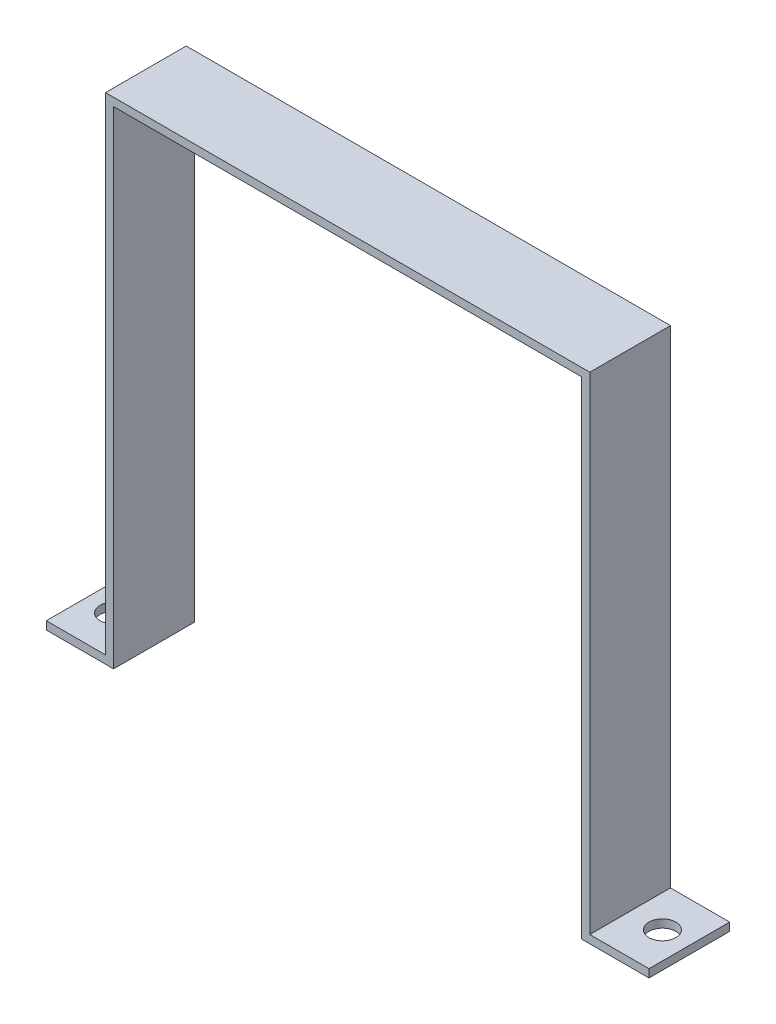
ISO-10303-21;
HEADER;
FILE_DESCRIPTION(('STEP AP214'),'2;1');
FILE_NAME('part.step','',(''),(''),'','','');
FILE_SCHEMA(('AUTOMOTIVE_DESIGN { 1 0 10303 214 1 1 1 1 }'));
ENDSEC;
DATA;
#1=APPLICATION_CONTEXT('core data for automotive mechanical design processes');
#2=APPLICATION_PROTOCOL_DEFINITION('international standard','automotive_design',2000,#1);
#3=PRODUCT_CONTEXT('',#1,'mechanical');
#4=PRODUCT('Part','Part','',(#3));
#5=PRODUCT_RELATED_PRODUCT_CATEGORY('part','',(#4));
#6=PRODUCT_DEFINITION_FORMATION('','',#4);
#7=PRODUCT_DEFINITION_CONTEXT('part definition',#1,'design');
#8=PRODUCT_DEFINITION('design','',#6,#7);
#9=PRODUCT_DEFINITION_SHAPE('','',#8);
#10=(LENGTH_UNIT() NAMED_UNIT(*) SI_UNIT(.MILLI.,.METRE.));
#11=(NAMED_UNIT(*) PLANE_ANGLE_UNIT() SI_UNIT($,.RADIAN.));
#12=(NAMED_UNIT(*) SI_UNIT($,.STERADIAN.) SOLID_ANGLE_UNIT());
#13=UNCERTAINTY_MEASURE_WITH_UNIT(LENGTH_MEASURE(1.E-05),#10,'distance_accuracy_value','');
#14=(GEOMETRIC_REPRESENTATION_CONTEXT(3) GLOBAL_UNCERTAINTY_ASSIGNED_CONTEXT((#13)) GLOBAL_UNIT_ASSIGNED_CONTEXT((#10,
#11,#12)) REPRESENTATION_CONTEXT('',''));
#15=CARTESIAN_POINT('',(0.,0.,0.));
#16=DIRECTION('',(0.,0.,1.));
#17=DIRECTION('',(1.,0.,0.));
#18=AXIS2_PLACEMENT_3D('',#15,#16,#17);
#19=CARTESIAN_POINT('',(-112.,0.,30.));
#20=DIRECTION('',(0.,1.,0.));
#21=DIRECTION('',(0.,0.,1.));
#22=AXIS2_PLACEMENT_3D('',#19,#20,#21);
#23=PLANE('',#22);
#24=CARTESIAN_POINT('',(-102.,0.,15.));
#25=DIRECTION('',(0.,1.,0.));
#26=DIRECTION('',(0.,0.,1.));
#27=AXIS2_PLACEMENT_3D('',#24,#25,#26);
#28=CIRCLE('',#27,5.);
#29=CARTESIAN_POINT('',(-102.,0.,20.));
#30=VERTEX_POINT('',#29);
#31=EDGE_CURVE('E301',#30,#30,#28,.T.);
#32=ORIENTED_EDGE('',*,*,#31,.T.);
#33=EDGE_LOOP('',(#32));
#34=FACE_BOUND('',#33,.T.);
#35=DIRECTION('',(1.,0.,0.));
#36=VECTOR('',#35,1.);
#37=CARTESIAN_POINT('',(-112.,0.,0.));
#38=LINE('',#37,#36);
#39=CARTESIAN_POINT('',(-112.,0.,0.));
#40=VERTEX_POINT('',#39);
#41=CARTESIAN_POINT('',(-87.,0.,0.));
#42=VERTEX_POINT('',#41);
#43=EDGE_CURVE('E164',#40,#42,#38,.T.);
#44=ORIENTED_EDGE('',*,*,#43,.T.);
#45=DIRECTION('',(0.,0.,-1.));
#46=VECTOR('',#45,1.);
#47=CARTESIAN_POINT('',(-87.,0.,30.));
#48=LINE('',#47,#46);
#49=CARTESIAN_POINT('',(-87.,0.,30.));
#50=VERTEX_POINT('',#49);
#51=EDGE_CURVE('E11',#50,#42,#48,.T.);
#52=ORIENTED_EDGE('',*,*,#51,.F.);
#53=DIRECTION('',(1.,0.,0.));
#54=VECTOR('',#53,1.);
#55=CARTESIAN_POINT('',(-112.,0.,30.));
#56=LINE('',#55,#54);
#57=CARTESIAN_POINT('',(-112.,0.,30.));
#58=VERTEX_POINT('',#57);
#59=EDGE_CURVE('E199',#58,#50,#56,.T.);
#60=ORIENTED_EDGE('',*,*,#59,.F.);
#61=DIRECTION('',(0.,0.,-1.));
#62=VECTOR('',#61,1.);
#63=CARTESIAN_POINT('',(-112.,0.,30.));
#64=LINE('',#63,#62);
#65=EDGE_CURVE('E160',#58,#40,#64,.T.);
#66=ORIENTED_EDGE('',*,*,#65,.T.);
#67=EDGE_LOOP('',(#44,#52,#60,#66));
#68=FACE_BOUND('',#67,.T.);
#69=ADVANCED_FACE('F39',(#34,#68),#23,.F.);
#70=CARTESIAN_POINT('',(-87.,0.,30.));
#71=DIRECTION('',(-1.,0.,0.));
#72=DIRECTION('',(0.,0.,1.));
#73=AXIS2_PLACEMENT_3D('',#70,#71,#72);
#74=PLANE('',#73);
#75=DIRECTION('',(0.,1.,0.));
#76=VECTOR('',#75,1.);
#77=CARTESIAN_POINT('',(-87.,0.,0.));
#78=LINE('',#77,#76);
#79=CARTESIAN_POINT('',(-87.,181.,0.));
#80=VERTEX_POINT('',#79);
#81=EDGE_CURVE('E168',#42,#80,#78,.T.);
#82=ORIENTED_EDGE('',*,*,#81,.T.);
#83=DIRECTION('',(0.,0.,-1.));
#84=VECTOR('',#83,1.);
#85=CARTESIAN_POINT('',(-87.,181.,30.));
#86=LINE('',#85,#84);
#87=CARTESIAN_POINT('',(-87.,181.,30.));
#88=VERTEX_POINT('',#87);
#89=EDGE_CURVE('E48',#88,#80,#86,.T.);
#90=ORIENTED_EDGE('',*,*,#89,.F.);
#91=DIRECTION('',(0.,1.,0.));
#92=VECTOR('',#91,1.);
#93=CARTESIAN_POINT('',(-87.,0.,30.));
#94=LINE('',#93,#92);
#95=EDGE_CURVE('E111',#50,#88,#94,.T.);
#96=ORIENTED_EDGE('',*,*,#95,.F.);
#97=ORIENTED_EDGE('',*,*,#51,.T.);
#98=EDGE_LOOP('',(#82,#90,#96,#97));
#99=FACE_BOUND('',#98,.T.);
#100=ADVANCED_FACE('F294',(#99),#74,.F.);
#101=CARTESIAN_POINT('',(-87.,181.,30.));
#102=DIRECTION('',(0.,1.,0.));
#103=DIRECTION('',(0.,0.,1.));
#104=AXIS2_PLACEMENT_3D('',#101,#102,#103);
#105=PLANE('',#104);
#106=DIRECTION('',(1.,0.,0.));
#107=VECTOR('',#106,1.);
#108=CARTESIAN_POINT('',(-87.,181.,0.));
#109=LINE('',#108,#107);
#110=CARTESIAN_POINT('',(87.,181.,0.));
#111=VERTEX_POINT('',#110);
#112=EDGE_CURVE('E172',#80,#111,#109,.T.);
#113=ORIENTED_EDGE('',*,*,#112,.T.);
#114=DIRECTION('',(0.,0.,-1.));
#115=VECTOR('',#114,1.);
#116=CARTESIAN_POINT('',(87.,181.,30.));
#117=LINE('',#116,#115);
#118=CARTESIAN_POINT('',(87.,181.,30.));
#119=VERTEX_POINT('',#118);
#120=EDGE_CURVE('E226',#119,#111,#117,.T.);
#121=ORIENTED_EDGE('',*,*,#120,.F.);
#122=DIRECTION('',(1.,0.,0.));
#123=VECTOR('',#122,1.);
#124=CARTESIAN_POINT('',(-87.,181.,30.));
#125=LINE('',#124,#123);
#126=EDGE_CURVE('E236',#88,#119,#125,.T.);
#127=ORIENTED_EDGE('',*,*,#126,.F.);
#128=ORIENTED_EDGE('',*,*,#89,.T.);
#129=EDGE_LOOP('',(#113,#121,#127,#128));
#130=FACE_BOUND('',#129,.T.);
#131=ADVANCED_FACE('F234',(#130),#105,.F.);
#132=CARTESIAN_POINT('',(87.,181.,30.));
#133=DIRECTION('',(1.,0.,0.));
#134=DIRECTION('',(0.,1.,0.));
#135=AXIS2_PLACEMENT_3D('',#132,#133,#134);
#136=PLANE('',#135);
#137=DIRECTION('',(0.,-1.,0.));
#138=VECTOR('',#137,1.);
#139=CARTESIAN_POINT('',(87.,181.,0.));
#140=LINE('',#139,#138);
#141=CARTESIAN_POINT('',(87.,0.,0.));
#142=VERTEX_POINT('',#141);
#143=EDGE_CURVE('E175',#111,#142,#140,.T.);
#144=ORIENTED_EDGE('',*,*,#143,.T.);
#145=DIRECTION('',(0.,0.,-1.));
#146=VECTOR('',#145,1.);
#147=CARTESIAN_POINT('',(87.,0.,30.));
#148=LINE('',#147,#146);
#149=CARTESIAN_POINT('',(87.,0.,30.));
#150=VERTEX_POINT('',#149);
#151=EDGE_CURVE('E222',#150,#142,#148,.T.);
#152=ORIENTED_EDGE('',*,*,#151,.F.);
#153=DIRECTION('',(0.,-1.,0.));
#154=VECTOR('',#153,1.);
#155=CARTESIAN_POINT('',(87.,181.,30.));
#156=LINE('',#155,#154);
#157=EDGE_CURVE('E255',#119,#150,#156,.T.);
#158=ORIENTED_EDGE('',*,*,#157,.F.);
#159=ORIENTED_EDGE('',*,*,#120,.T.);
#160=EDGE_LOOP('',(#144,#152,#158,#159));
#161=FACE_BOUND('',#160,.T.);
#162=ADVANCED_FACE('F245',(#161),#136,.F.);
#163=CARTESIAN_POINT('',(87.,0.,30.));
#164=DIRECTION('',(0.,1.,0.));
#165=DIRECTION('',(0.,0.,1.));
#166=AXIS2_PLACEMENT_3D('',#163,#164,#165);
#167=PLANE('',#166);
#168=CARTESIAN_POINT('',(102.,0.,15.));
#169=DIRECTION('',(0.,1.,0.));
#170=DIRECTION('',(0.,0.,1.));
#171=AXIS2_PLACEMENT_3D('',#168,#169,#170);
#172=CIRCLE('',#171,4.99999999999999);
#173=CARTESIAN_POINT('',(102.,0.,20.));
#174=VERTEX_POINT('',#173);
#175=EDGE_CURVE('E169',#174,#174,#172,.T.);
#176=ORIENTED_EDGE('',*,*,#175,.T.);
#177=EDGE_LOOP('',(#176));
#178=FACE_BOUND('',#177,.T.);
#179=DIRECTION('',(1.,0.,0.));
#180=VECTOR('',#179,1.);
#181=CARTESIAN_POINT('',(87.,0.,0.));
#182=LINE('',#181,#180);
#183=CARTESIAN_POINT('',(112.,0.,0.));
#184=VERTEX_POINT('',#183);
#185=EDGE_CURVE('E178',#142,#184,#182,.T.);
#186=ORIENTED_EDGE('',*,*,#185,.T.);
#187=DIRECTION('',(0.,0.,-1.));
#188=VECTOR('',#187,1.);
#189=CARTESIAN_POINT('',(112.,0.,30.));
#190=LINE('',#189,#188);
#191=CARTESIAN_POINT('',(112.,0.,30.));
#192=VERTEX_POINT('',#191);
#193=EDGE_CURVE('E218',#192,#184,#190,.T.);
#194=ORIENTED_EDGE('',*,*,#193,.F.);
#195=DIRECTION('',(1.,0.,0.));
#196=VECTOR('',#195,1.);
#197=CARTESIAN_POINT('',(87.,0.,30.));
#198=LINE('',#197,#196);
#199=EDGE_CURVE('E251',#150,#192,#198,.T.);
#200=ORIENTED_EDGE('',*,*,#199,.F.);
#201=ORIENTED_EDGE('',*,*,#151,.T.);
#202=EDGE_LOOP('',(#186,#194,#200,#201));
#203=FACE_BOUND('',#202,.T.);
#204=ADVANCED_FACE('F249',(#178,#203),#167,.F.);
#205=CARTESIAN_POINT('',(112.,0.,30.));
#206=DIRECTION('',(-1.,0.,0.));
#207=DIRECTION('',(0.,0.,1.));
#208=AXIS2_PLACEMENT_3D('',#205,#206,#207);
#209=PLANE('',#208);
#210=DIRECTION('',(0.,1.,0.));
#211=VECTOR('',#210,1.);
#212=CARTESIAN_POINT('',(112.,0.,0.));
#213=LINE('',#212,#211);
#214=CARTESIAN_POINT('',(112.,3.,0.));
#215=VERTEX_POINT('',#214);
#216=EDGE_CURVE('E181',#184,#215,#213,.T.);
#217=ORIENTED_EDGE('',*,*,#216,.T.);
#218=DIRECTION('',(0.,0.,-1.));
#219=VECTOR('',#218,1.);
#220=CARTESIAN_POINT('',(112.,3.,30.));
#221=LINE('',#220,#219);
#222=CARTESIAN_POINT('',(112.,3.,30.));
#223=VERTEX_POINT('',#222);
#224=EDGE_CURVE('E214',#223,#215,#221,.T.);
#225=ORIENTED_EDGE('',*,*,#224,.F.);
#226=DIRECTION('',(0.,1.,0.));
#227=VECTOR('',#226,1.);
#228=CARTESIAN_POINT('',(112.,0.,30.));
#229=LINE('',#228,#227);
#230=EDGE_CURVE('E254',#192,#223,#229,.T.);
#231=ORIENTED_EDGE('',*,*,#230,.F.);
#232=ORIENTED_EDGE('',*,*,#193,.T.);
#233=EDGE_LOOP('',(#217,#225,#231,#232));
#234=FACE_BOUND('',#233,.T.);
#235=ADVANCED_FACE('F329',(#234),#209,.F.);
#236=CARTESIAN_POINT('',(112.,3.,30.));
#237=DIRECTION('',(0.,-1.,0.));
#238=DIRECTION('',(1.,0.,0.));
#239=AXIS2_PLACEMENT_3D('',#236,#237,#238);
#240=PLANE('',#239);
#241=CARTESIAN_POINT('',(102.,3.00000000000003,15.));
#242=DIRECTION('',(0.,1.,0.));
#243=DIRECTION('',(-1.,0.,0.));
#244=AXIS2_PLACEMENT_3D('',#241,#242,#243);
#245=CIRCLE('',#244,4.99999999999999);
#246=CARTESIAN_POINT('',(97.0000000000001,3.00000000000002,15.));
#247=VERTEX_POINT('',#246);
#248=EDGE_CURVE('E311',#247,#247,#245,.T.);
#249=ORIENTED_EDGE('',*,*,#248,.F.);
#250=EDGE_LOOP('',(#249));
#251=FACE_BOUND('',#250,.T.);
#252=DIRECTION('',(-1.,0.,0.));
#253=VECTOR('',#252,1.);
#254=CARTESIAN_POINT('',(112.,3.,0.));
#255=LINE('',#254,#253);
#256=CARTESIAN_POINT('',(90.0000000000001,3.,0.));
#257=VERTEX_POINT('',#256);
#258=EDGE_CURVE('E184',#215,#257,#255,.T.);
#259=ORIENTED_EDGE('',*,*,#258,.T.);
#260=DIRECTION('',(0.,0.,-1.));
#261=VECTOR('',#260,1.);
#262=CARTESIAN_POINT('',(90.0000000000001,3.,30.));
#263=LINE('',#262,#261);
#264=CARTESIAN_POINT('',(90.0000000000001,3.,30.));
#265=VERTEX_POINT('',#264);
#266=EDGE_CURVE('E210',#265,#257,#263,.T.);
#267=ORIENTED_EDGE('',*,*,#266,.F.);
#268=DIRECTION('',(-1.,0.,0.));
#269=VECTOR('',#268,1.);
#270=CARTESIAN_POINT('',(112.,3.,30.));
#271=LINE('',#270,#269);
#272=EDGE_CURVE('E259',#223,#265,#271,.T.);
#273=ORIENTED_EDGE('',*,*,#272,.F.);
#274=ORIENTED_EDGE('',*,*,#224,.T.);
#275=EDGE_LOOP('',(#259,#267,#273,#274));
#276=FACE_BOUND('',#275,.T.);
#277=ADVANCED_FACE('F326',(#251,#276),#240,.F.);
#278=CARTESIAN_POINT('',(90.0000000000001,3.,30.));
#279=DIRECTION('',(-1.,0.,0.));
#280=DIRECTION('',(0.,0.,1.));
#281=AXIS2_PLACEMENT_3D('',#278,#279,#280);
#282=PLANE('',#281);
#283=DIRECTION('',(0.,1.,0.));
#284=VECTOR('',#283,1.);
#285=CARTESIAN_POINT('',(90.0000000000001,3.,0.));
#286=LINE('',#285,#284);
#287=CARTESIAN_POINT('',(90.0000000000001,184.,0.));
#288=VERTEX_POINT('',#287);
#289=EDGE_CURVE('E187',#257,#288,#286,.T.);
#290=ORIENTED_EDGE('',*,*,#289,.T.);
#291=DIRECTION('',(0.,0.,-1.));
#292=VECTOR('',#291,1.);
#293=CARTESIAN_POINT('',(90.0000000000001,184.,30.));
#294=LINE('',#293,#292);
#295=CARTESIAN_POINT('',(90.0000000000001,184.,30.));
#296=VERTEX_POINT('',#295);
#297=EDGE_CURVE('E206',#296,#288,#294,.T.);
#298=ORIENTED_EDGE('',*,*,#297,.F.);
#299=DIRECTION('',(0.,1.,0.));
#300=VECTOR('',#299,1.);
#301=CARTESIAN_POINT('',(90.0000000000001,3.,30.));
#302=LINE('',#301,#300);
#303=EDGE_CURVE('E266',#265,#296,#302,.T.);
#304=ORIENTED_EDGE('',*,*,#303,.F.);
#305=ORIENTED_EDGE('',*,*,#266,.T.);
#306=EDGE_LOOP('',(#290,#298,#304,#305));
#307=FACE_BOUND('',#306,.T.);
#308=ADVANCED_FACE('F274',(#307),#282,.F.);
#309=CARTESIAN_POINT('',(90.0000000000001,184.,30.));
#310=DIRECTION('',(0.,-1.,0.));
#311=DIRECTION('',(1.,0.,0.));
#312=AXIS2_PLACEMENT_3D('',#309,#310,#311);
#313=PLANE('',#312);
#314=DIRECTION('',(-1.,0.,0.));
#315=VECTOR('',#314,1.);
#316=CARTESIAN_POINT('',(90.0000000000001,184.,0.));
#317=LINE('',#316,#315);
#318=CARTESIAN_POINT('',(-90.,184.,0.));
#319=VERTEX_POINT('',#318);
#320=EDGE_CURVE('E190',#288,#319,#317,.T.);
#321=ORIENTED_EDGE('',*,*,#320,.T.);
#322=DIRECTION('',(0.,0.,-1.));
#323=VECTOR('',#322,1.);
#324=CARTESIAN_POINT('',(-90.,184.,30.));
#325=LINE('',#324,#323);
#326=CARTESIAN_POINT('',(-90.,184.,30.));
#327=VERTEX_POINT('',#326);
#328=EDGE_CURVE('E153',#327,#319,#325,.T.);
#329=ORIENTED_EDGE('',*,*,#328,.F.);
#330=DIRECTION('',(-1.,0.,0.));
#331=VECTOR('',#330,1.);
#332=CARTESIAN_POINT('',(90.0000000000001,184.,30.));
#333=LINE('',#332,#331);
#334=EDGE_CURVE('E142',#296,#327,#333,.T.);
#335=ORIENTED_EDGE('',*,*,#334,.F.);
#336=ORIENTED_EDGE('',*,*,#297,.T.);
#337=EDGE_LOOP('',(#321,#329,#335,#336));
#338=FACE_BOUND('',#337,.T.);
#339=ADVANCED_FACE('F278',(#338),#313,.F.);
#340=CARTESIAN_POINT('',(-90.,184.,30.));
#341=DIRECTION('',(1.,0.,0.));
#342=DIRECTION('',(0.,1.,0.));
#343=AXIS2_PLACEMENT_3D('',#340,#341,#342);
#344=PLANE('',#343);
#345=DIRECTION('',(0.,-1.,0.));
#346=VECTOR('',#345,1.);
#347=CARTESIAN_POINT('',(-90.,184.,0.));
#348=LINE('',#347,#346);
#349=CARTESIAN_POINT('',(-90.,3.,0.));
#350=VERTEX_POINT('',#349);
#351=EDGE_CURVE('E151',#319,#350,#348,.T.);
#352=ORIENTED_EDGE('',*,*,#351,.T.);
#353=DIRECTION('',(0.,0.,-1.));
#354=VECTOR('',#353,1.);
#355=CARTESIAN_POINT('',(-90.,3.,30.));
#356=LINE('',#355,#354);
#357=CARTESIAN_POINT('',(-90.,3.,30.));
#358=VERTEX_POINT('',#357);
#359=EDGE_CURVE('E148',#358,#350,#356,.T.);
#360=ORIENTED_EDGE('',*,*,#359,.F.);
#361=DIRECTION('',(0.,-1.,0.));
#362=VECTOR('',#361,1.);
#363=CARTESIAN_POINT('',(-90.,184.,30.));
#364=LINE('',#363,#362);
#365=EDGE_CURVE('E136',#327,#358,#364,.T.);
#366=ORIENTED_EDGE('',*,*,#365,.F.);
#367=ORIENTED_EDGE('',*,*,#328,.T.);
#368=EDGE_LOOP('',(#352,#360,#366,#367));
#369=FACE_BOUND('',#368,.T.);
#370=ADVANCED_FACE('F149',(#369),#344,.F.);
#371=CARTESIAN_POINT('',(-90.,3.,30.));
#372=DIRECTION('',(0.,-1.,0.));
#373=DIRECTION('',(1.,0.,0.));
#374=AXIS2_PLACEMENT_3D('',#371,#372,#373);
#375=PLANE('',#374);
#376=CARTESIAN_POINT('',(-102.,3.,15.));
#377=DIRECTION('',(0.,1.,0.));
#378=DIRECTION('',(-1.,0.,0.));
#379=AXIS2_PLACEMENT_3D('',#376,#377,#378);
#380=CIRCLE('',#379,5.);
#381=CARTESIAN_POINT('',(-107.,3.,15.));
#382=VERTEX_POINT('',#381);
#383=EDGE_CURVE('E304',#382,#382,#380,.T.);
#384=ORIENTED_EDGE('',*,*,#383,.F.);
#385=EDGE_LOOP('',(#384));
#386=FACE_BOUND('',#385,.T.);
#387=DIRECTION('',(-1.,0.,0.));
#388=VECTOR('',#387,1.);
#389=CARTESIAN_POINT('',(-90.,3.,0.));
#390=LINE('',#389,#388);
#391=CARTESIAN_POINT('',(-112.,3.,0.));
#392=VERTEX_POINT('',#391);
#393=EDGE_CURVE('E97',#350,#392,#390,.T.);
#394=ORIENTED_EDGE('',*,*,#393,.T.);
#395=DIRECTION('',(0.,0.,-1.));
#396=VECTOR('',#395,1.);
#397=CARTESIAN_POINT('',(-112.,3.,30.));
#398=LINE('',#397,#396);
#399=CARTESIAN_POINT('',(-112.,3.,30.));
#400=VERTEX_POINT('',#399);
#401=EDGE_CURVE('E154',#400,#392,#398,.T.);
#402=ORIENTED_EDGE('',*,*,#401,.F.);
#403=DIRECTION('',(-1.,0.,0.));
#404=VECTOR('',#403,1.);
#405=CARTESIAN_POINT('',(-90.,3.,30.));
#406=LINE('',#405,#404);
#407=EDGE_CURVE('E140',#358,#400,#406,.T.);
#408=ORIENTED_EDGE('',*,*,#407,.F.);
#409=ORIENTED_EDGE('',*,*,#359,.T.);
#410=EDGE_LOOP('',(#394,#402,#408,#409));
#411=FACE_BOUND('',#410,.T.);
#412=ADVANCED_FACE('F156',(#386,#411),#375,.F.);
#413=CARTESIAN_POINT('',(-112.,3.,30.));
#414=DIRECTION('',(1.,0.,0.));
#415=DIRECTION('',(0.,0.,-1.));
#416=AXIS2_PLACEMENT_3D('',#413,#414,#415);
#417=PLANE('',#416);
#418=DIRECTION('',(0.,-1.,0.));
#419=VECTOR('',#418,1.);
#420=CARTESIAN_POINT('',(-112.,3.,0.));
#421=LINE('',#420,#419);
#422=EDGE_CURVE('E103',#392,#40,#421,.T.);
#423=ORIENTED_EDGE('',*,*,#422,.T.);
#424=ORIENTED_EDGE('',*,*,#65,.F.);
#425=DIRECTION('',(0.,-1.,0.));
#426=VECTOR('',#425,1.);
#427=CARTESIAN_POINT('',(-112.,3.,30.));
#428=LINE('',#427,#426);
#429=EDGE_CURVE('E56',#400,#58,#428,.T.);
#430=ORIENTED_EDGE('',*,*,#429,.F.);
#431=ORIENTED_EDGE('',*,*,#401,.T.);
#432=EDGE_LOOP('',(#423,#424,#430,#431));
#433=FACE_BOUND('',#432,.T.);
#434=ADVANCED_FACE('F282',(#433),#417,.F.);
#435=CARTESIAN_POINT('',(0.,0.,30.));
#436=DIRECTION('',(0.,0.,1.));
#437=DIRECTION('',(1.,0.,0.));
#438=AXIS2_PLACEMENT_3D('',#435,#436,#437);
#439=PLANE('',#438);
#440=ORIENTED_EDGE('',*,*,#59,.T.);
#441=ORIENTED_EDGE('',*,*,#95,.T.);
#442=ORIENTED_EDGE('',*,*,#126,.T.);
#443=ORIENTED_EDGE('',*,*,#157,.T.);
#444=ORIENTED_EDGE('',*,*,#199,.T.);
#445=ORIENTED_EDGE('',*,*,#230,.T.);
#446=ORIENTED_EDGE('',*,*,#272,.T.);
#447=ORIENTED_EDGE('',*,*,#303,.T.);
#448=ORIENTED_EDGE('',*,*,#334,.T.);
#449=ORIENTED_EDGE('',*,*,#365,.T.);
#450=ORIENTED_EDGE('',*,*,#407,.T.);
#451=ORIENTED_EDGE('',*,*,#429,.T.);
#452=EDGE_LOOP('',(#440,#441,#442,#443,#444,#445,#446,#447,#448,#449,#450,#451));
#453=FACE_BOUND('',#452,.T.);
#454=ADVANCED_FACE('F138',(#453),#439,.T.);
#455=CARTESIAN_POINT('',(0.,0.,0.));
#456=DIRECTION('',(0.,0.,1.));
#457=DIRECTION('',(1.,0.,0.));
#458=AXIS2_PLACEMENT_3D('',#455,#456,#457);
#459=PLANE('',#458);
#460=ORIENTED_EDGE('',*,*,#43,.F.);
#461=ORIENTED_EDGE('',*,*,#422,.F.);
#462=ORIENTED_EDGE('',*,*,#393,.F.);
#463=ORIENTED_EDGE('',*,*,#351,.F.);
#464=ORIENTED_EDGE('',*,*,#320,.F.);
#465=ORIENTED_EDGE('',*,*,#289,.F.);
#466=ORIENTED_EDGE('',*,*,#258,.F.);
#467=ORIENTED_EDGE('',*,*,#216,.F.);
#468=ORIENTED_EDGE('',*,*,#185,.F.);
#469=ORIENTED_EDGE('',*,*,#143,.F.);
#470=ORIENTED_EDGE('',*,*,#112,.F.);
#471=ORIENTED_EDGE('',*,*,#81,.F.);
#472=EDGE_LOOP('',(#460,#461,#462,#463,#464,#465,#466,#467,#468,#469,#470,#471));
#473=FACE_BOUND('',#472,.T.);
#474=ADVANCED_FACE('F240',(#473),#459,.F.);
#475=CARTESIAN_POINT('',(-102.,-27.,15.));
#476=DIRECTION('',(0.,1.,0.));
#477=DIRECTION('',(-1.,0.,0.));
#478=AXIS2_PLACEMENT_3D('',#475,#476,#477);
#479=CYLINDRICAL_SURFACE('',#478,5.);
#480=ORIENTED_EDGE('',*,*,#383,.T.);
#481=EDGE_LOOP('',(#480));
#482=FACE_BOUND('',#481,.T.);
#483=ORIENTED_EDGE('',*,*,#31,.F.);
#484=EDGE_LOOP('',(#483));
#485=FACE_BOUND('',#484,.T.);
#486=ADVANCED_FACE('F384',(#482,#485),#479,.F.);
#487=CARTESIAN_POINT('',(102.,-27.,15.));
#488=DIRECTION('',(0.,1.,0.));
#489=DIRECTION('',(-1.,0.,0.));
#490=AXIS2_PLACEMENT_3D('',#487,#488,#489);
#491=CYLINDRICAL_SURFACE('',#490,4.99999999999999);
#492=ORIENTED_EDGE('',*,*,#248,.T.);
#493=EDGE_LOOP('',(#492));
#494=FACE_BOUND('',#493,.T.);
#495=ORIENTED_EDGE('',*,*,#175,.F.);
#496=EDGE_LOOP('',(#495));
#497=FACE_BOUND('',#496,.T.);
#498=ADVANCED_FACE('F323',(#494,#497),#491,.F.);
#499=CLOSED_SHELL('',(#69,#100,#131,#162,#204,#235,#277,#308,#339,#370,#412,#434,#454,#474,#486,#498));
#500=MANIFOLD_SOLID_BREP('B2',#499);
#501=ADVANCED_BREP_SHAPE_REPRESENTATION('',(#18,#500),#14);
#502=SHAPE_DEFINITION_REPRESENTATION(#9,#501);
ENDSEC;
END-ISO-10303-21;
